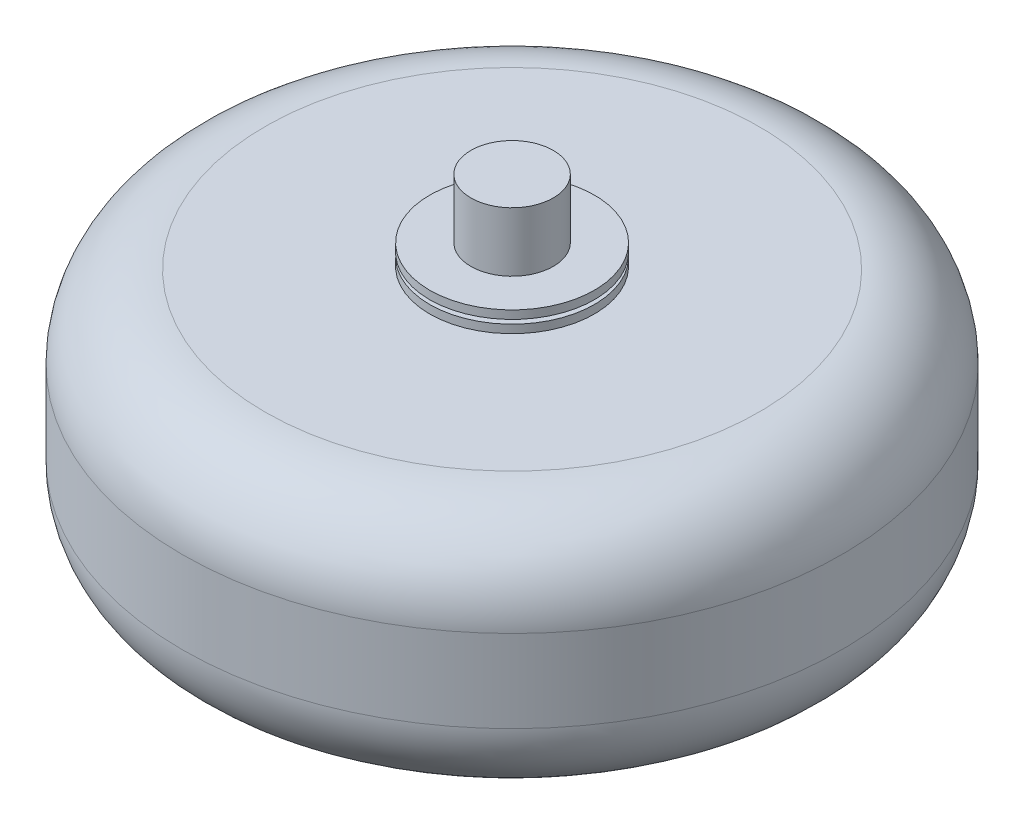
ISO-10303-21;
HEADER;
FILE_DESCRIPTION(('STEP AP214'),'2;1');
FILE_NAME('part.step','',(''),(''),'','','');
FILE_SCHEMA(('AUTOMOTIVE_DESIGN { 1 0 10303 214 1 1 1 1 }'));
ENDSEC;
DATA;
#1=APPLICATION_CONTEXT('core data for automotive mechanical design processes');
#2=APPLICATION_PROTOCOL_DEFINITION('international standard','automotive_design',2000,#1);
#3=PRODUCT_CONTEXT('',#1,'mechanical');
#4=PRODUCT('Part','Part','',(#3));
#5=PRODUCT_RELATED_PRODUCT_CATEGORY('part','',(#4));
#6=PRODUCT_DEFINITION_FORMATION('','',#4);
#7=PRODUCT_DEFINITION_CONTEXT('part definition',#1,'design');
#8=PRODUCT_DEFINITION('design','',#6,#7);
#9=PRODUCT_DEFINITION_SHAPE('','',#8);
#10=(LENGTH_UNIT() NAMED_UNIT(*) SI_UNIT(.MILLI.,.METRE.));
#11=(NAMED_UNIT(*) PLANE_ANGLE_UNIT() SI_UNIT($,.RADIAN.));
#12=(NAMED_UNIT(*) SI_UNIT($,.STERADIAN.) SOLID_ANGLE_UNIT());
#13=UNCERTAINTY_MEASURE_WITH_UNIT(LENGTH_MEASURE(1.E-05),#10,'distance_accuracy_value','');
#14=(GEOMETRIC_REPRESENTATION_CONTEXT(3) GLOBAL_UNCERTAINTY_ASSIGNED_CONTEXT((#13)) GLOBAL_UNIT_ASSIGNED_CONTEXT((#10,
#11,#12)) REPRESENTATION_CONTEXT('',''));
#15=CARTESIAN_POINT('',(0.,0.,0.));
#16=DIRECTION('',(0.,0.,1.));
#17=DIRECTION('',(1.,0.,0.));
#18=AXIS2_PLACEMENT_3D('',#15,#16,#17);
#19=CARTESIAN_POINT('',(0.,-63.5,0.));
#20=DIRECTION('',(0.,1.,0.));
#21=DIRECTION('',(0.,0.,1.));
#22=AXIS2_PLACEMENT_3D('',#19,#20,#21);
#23=CYLINDRICAL_SURFACE('',#22,12.7);
#24=CARTESIAN_POINT('',(0.,-38.1,0.));
#25=DIRECTION('',(0.,-1.,0.));
#26=DIRECTION('',(0.,0.,-1.));
#27=AXIS2_PLACEMENT_3D('',#24,#25,#26);
#28=CIRCLE('',#27,12.7);
#29=CARTESIAN_POINT('',(0.,-38.1,-12.7));
#30=VERTEX_POINT('',#29);
#31=EDGE_CURVE('E99',#30,#30,#28,.T.);
#32=ORIENTED_EDGE('',*,*,#31,.T.);
#33=EDGE_LOOP('',(#32));
#34=FACE_BOUND('',#33,.T.);
#35=CARTESIAN_POINT('',(0.,-38.862,0.));
#36=DIRECTION('',(0.,-1.,0.));
#37=DIRECTION('',(0.,0.,-1.));
#38=AXIS2_PLACEMENT_3D('',#35,#36,#37);
#39=CIRCLE('',#38,12.7);
#40=CARTESIAN_POINT('',(0.,-38.862,-12.7));
#41=VERTEX_POINT('',#40);
#42=EDGE_CURVE('E45',#41,#41,#39,.F.);
#43=ORIENTED_EDGE('',*,*,#42,.T.);
#44=EDGE_LOOP('',(#43));
#45=FACE_BOUND('',#44,.T.);
#46=ADVANCED_FACE('F41',(#34,#45),#23,.T.);
#47=CARTESIAN_POINT('',(0.,38.1,0.));
#48=DIRECTION('',(0.,1.,0.));
#49=DIRECTION('',(0.,0.,1.));
#50=AXIS2_PLACEMENT_3D('',#47,#48,#49);
#51=CIRCLE('',#50,12.7);
#52=CARTESIAN_POINT('',(0.,38.1,12.7));
#53=VERTEX_POINT('',#52);
#54=EDGE_CURVE('E103',#53,#53,#51,.T.);
#55=ORIENTED_EDGE('',*,*,#54,.T.);
#56=EDGE_LOOP('',(#55));
#57=FACE_BOUND('',#56,.T.);
#58=CARTESIAN_POINT('',(0.,38.862,0.));
#59=DIRECTION('',(0.,1.,0.));
#60=DIRECTION('',(0.,0.,1.));
#61=AXIS2_PLACEMENT_3D('',#58,#59,#60);
#62=CIRCLE('',#61,12.7);
#63=CARTESIAN_POINT('',(0.,38.862,12.7));
#64=VERTEX_POINT('',#63);
#65=EDGE_CURVE('E64',#64,#64,#62,.F.);
#66=ORIENTED_EDGE('',*,*,#65,.T.);
#67=EDGE_LOOP('',(#66));
#68=FACE_BOUND('',#67,.T.);
#69=ADVANCED_FACE('F162',(#57,#68),#23,.T.);
#70=CARTESIAN_POINT('',(0.,-38.1,0.));
#71=DIRECTION('',(0.,1.,0.));
#72=DIRECTION('',(0.,0.,1.));
#73=AXIS2_PLACEMENT_3D('',#70,#71,#72);
#74=CYLINDRICAL_SURFACE('',#73,101.6);
#75=CARTESIAN_POINT('',(0.,12.7,0.));
#76=DIRECTION('',(0.,1.,0.));
#77=DIRECTION('',(0.,0.,1.));
#78=AXIS2_PLACEMENT_3D('',#75,#76,#77);
#79=CIRCLE('',#78,101.6);
#80=CARTESIAN_POINT('',(0.,12.7,101.6));
#81=VERTEX_POINT('',#80);
#82=EDGE_CURVE('E87',#81,#81,#79,.F.);
#83=ORIENTED_EDGE('',*,*,#82,.T.);
#84=EDGE_LOOP('',(#83));
#85=FACE_BOUND('',#84,.T.);
#86=CARTESIAN_POINT('',(0.,-12.7,0.));
#87=DIRECTION('',(0.,1.,0.));
#88=DIRECTION('',(0.,0.,1.));
#89=AXIS2_PLACEMENT_3D('',#86,#87,#88);
#90=CIRCLE('',#89,101.6);
#91=CARTESIAN_POINT('',(0.,-12.7,101.6));
#92=VERTEX_POINT('',#91);
#93=EDGE_CURVE('E91',#92,#92,#90,.T.);
#94=ORIENTED_EDGE('',*,*,#93,.T.);
#95=EDGE_LOOP('',(#94));
#96=FACE_BOUND('',#95,.T.);
#97=ADVANCED_FACE('F172',(#85,#96),#74,.T.);
#98=CARTESIAN_POINT('',(0.,-38.1,0.));
#99=DIRECTION('',(0.,1.,0.));
#100=DIRECTION('',(0.,0.,1.));
#101=AXIS2_PLACEMENT_3D('',#98,#99,#100);
#102=PLANE('',#101);
#103=CARTESIAN_POINT('',(0.,-38.1,0.));
#104=DIRECTION('',(0.,1.,0.));
#105=DIRECTION('',(0.,0.,1.));
#106=AXIS2_PLACEMENT_3D('',#103,#104,#105);
#107=CIRCLE('',#106,76.2);
#108=CARTESIAN_POINT('',(0.,-38.1,76.2));
#109=VERTEX_POINT('',#108);
#110=EDGE_CURVE('E77',#109,#109,#107,.F.);
#111=ORIENTED_EDGE('',*,*,#110,.T.);
#112=EDGE_LOOP('',(#111));
#113=FACE_BOUND('',#112,.T.);
#114=ORIENTED_EDGE('',*,*,#31,.F.);
#115=EDGE_LOOP('',(#114));
#116=FACE_BOUND('',#115,.T.);
#117=ADVANCED_FACE('F345',(#113,#116),#102,.F.);
#118=CARTESIAN_POINT('',(0.,38.1,0.));
#119=DIRECTION('',(0.,1.,0.));
#120=DIRECTION('',(0.,0.,1.));
#121=AXIS2_PLACEMENT_3D('',#118,#119,#120);
#122=PLANE('',#121);
#123=CARTESIAN_POINT('',(0.,38.1,0.));
#124=DIRECTION('',(0.,1.,0.));
#125=DIRECTION('',(0.,0.,1.));
#126=AXIS2_PLACEMENT_3D('',#123,#124,#125);
#127=CIRCLE('',#126,76.2);
#128=CARTESIAN_POINT('',(0.,38.1,76.2));
#129=VERTEX_POINT('',#128);
#130=EDGE_CURVE('E95',#129,#129,#127,.T.);
#131=ORIENTED_EDGE('',*,*,#130,.T.);
#132=EDGE_LOOP('',(#131));
#133=FACE_BOUND('',#132,.T.);
#134=ORIENTED_EDGE('',*,*,#54,.F.);
#135=EDGE_LOOP('',(#134));
#136=FACE_BOUND('',#135,.T.);
#137=ADVANCED_FACE('F335',(#133,#136),#122,.T.);
#138=CARTESIAN_POINT('',(0.,12.7,0.));
#139=DIRECTION('',(0.,1.,0.));
#140=DIRECTION('',(0.,0.,1.));
#141=AXIS2_PLACEMENT_3D('',#138,#139,#140);
#142=TOROIDAL_SURFACE('',#141,76.2,25.4);
#143=ORIENTED_EDGE('',*,*,#82,.F.);
#144=EDGE_LOOP('',(#143));
#145=FACE_BOUND('',#144,.T.);
#146=ORIENTED_EDGE('',*,*,#130,.F.);
#147=EDGE_LOOP('',(#146));
#148=FACE_BOUND('',#147,.T.);
#149=ADVANCED_FACE('F325',(#145,#148),#142,.T.);
#150=CARTESIAN_POINT('',(0.,-12.7,0.));
#151=DIRECTION('',(0.,1.,0.));
#152=DIRECTION('',(0.,0.,1.));
#153=AXIS2_PLACEMENT_3D('',#150,#151,#152);
#154=TOROIDAL_SURFACE('',#153,76.2,25.4);
#155=ORIENTED_EDGE('',*,*,#110,.F.);
#156=EDGE_LOOP('',(#155));
#157=FACE_BOUND('',#156,.T.);
#158=ORIENTED_EDGE('',*,*,#93,.F.);
#159=EDGE_LOOP('',(#158));
#160=FACE_BOUND('',#159,.T.);
#161=ADVANCED_FACE('F43',(#157,#160),#154,.T.);
#162=CARTESIAN_POINT('',(0.,38.862,0.));
#163=DIRECTION('',(0.,1.,0.));
#164=DIRECTION('',(0.,0.,1.));
#165=AXIS2_PLACEMENT_3D('',#162,#163,#164);
#166=CYLINDRICAL_SURFACE('',#165,25.4);
#167=CARTESIAN_POINT('',(0.,38.862,0.));
#168=DIRECTION('',(0.,1.,0.));
#169=DIRECTION('',(0.,0.,1.));
#170=AXIS2_PLACEMENT_3D('',#167,#168,#169);
#171=CIRCLE('',#170,25.4);
#172=CARTESIAN_POINT('',(0.,38.862,25.4));
#173=VERTEX_POINT('',#172);
#174=EDGE_CURVE('E69',#173,#173,#171,.T.);
#175=ORIENTED_EDGE('',*,*,#174,.T.);
#176=EDGE_LOOP('',(#175));
#177=FACE_BOUND('',#176,.T.);
#178=CARTESIAN_POINT('',(0.,41.402,0.));
#179=DIRECTION('',(0.,1.,0.));
#180=DIRECTION('',(0.,0.,1.));
#181=AXIS2_PLACEMENT_3D('',#178,#179,#180);
#182=CIRCLE('',#181,25.4);
#183=CARTESIAN_POINT('',(0.,41.402,25.4));
#184=VERTEX_POINT('',#183);
#185=EDGE_CURVE('E62',#184,#184,#182,.T.);
#186=ORIENTED_EDGE('',*,*,#185,.F.);
#187=EDGE_LOOP('',(#186));
#188=FACE_BOUND('',#187,.T.);
#189=ADVANCED_FACE('F233',(#177,#188),#166,.T.);
#190=CARTESIAN_POINT('',(0.,38.862,0.));
#191=DIRECTION('',(0.,1.,0.));
#192=DIRECTION('',(0.,0.,1.));
#193=AXIS2_PLACEMENT_3D('',#190,#191,#192);
#194=PLANE('',#193);
#195=ORIENTED_EDGE('',*,*,#65,.F.);
#196=EDGE_LOOP('',(#195));
#197=FACE_BOUND('',#196,.T.);
#198=ORIENTED_EDGE('',*,*,#174,.F.);
#199=EDGE_LOOP('',(#198));
#200=FACE_BOUND('',#199,.T.);
#201=ADVANCED_FACE('F236',(#197,#200),#194,.F.);
#202=CARTESIAN_POINT('',(0.,41.402,0.));
#203=DIRECTION('',(0.,1.,0.));
#204=DIRECTION('',(0.,0.,1.));
#205=AXIS2_PLACEMENT_3D('',#202,#203,#204);
#206=PLANE('',#205);
#207=CARTESIAN_POINT('',(0.,41.402,0.));
#208=DIRECTION('',(0.,1.,0.));
#209=DIRECTION('',(0.,0.,1.));
#210=AXIS2_PLACEMENT_3D('',#207,#208,#209);
#211=CIRCLE('',#210,12.7);
#212=CARTESIAN_POINT('',(0.,41.402,12.7));
#213=VERTEX_POINT('',#212);
#214=EDGE_CURVE('E55',#213,#213,#211,.F.);
#215=ORIENTED_EDGE('',*,*,#214,.T.);
#216=EDGE_LOOP('',(#215));
#217=FACE_BOUND('',#216,.T.);
#218=ORIENTED_EDGE('',*,*,#185,.T.);
#219=EDGE_LOOP('',(#218));
#220=FACE_BOUND('',#219,.T.);
#221=ADVANCED_FACE('F192',(#217,#220),#206,.T.);
#222=CARTESIAN_POINT('',(0.,63.5,0.));
#223=DIRECTION('',(0.,1.,0.));
#224=DIRECTION('',(0.,0.,1.));
#225=AXIS2_PLACEMENT_3D('',#222,#223,#224);
#226=PLANE('',#225);
#227=CARTESIAN_POINT('',(0.,63.5,0.));
#228=DIRECTION('',(0.,1.,0.));
#229=DIRECTION('',(0.,0.,1.));
#230=AXIS2_PLACEMENT_3D('',#227,#228,#229);
#231=CIRCLE('',#230,12.7);
#232=CARTESIAN_POINT('',(0.,63.5,12.7));
#233=VERTEX_POINT('',#232);
#234=EDGE_CURVE('E82',#233,#233,#231,.T.);
#235=ORIENTED_EDGE('',*,*,#234,.T.);
#236=EDGE_LOOP('',(#235));
#237=FACE_BOUND('',#236,.T.);
#238=ADVANCED_FACE('F181',(#237),#226,.T.);
#239=CARTESIAN_POINT('',(0.,45.212,0.));
#240=DIRECTION('',(0.,1.,0.));
#241=DIRECTION('',(0.,0.,1.));
#242=AXIS2_PLACEMENT_3D('',#239,#240,#241);
#243=CIRCLE('',#242,12.7);
#244=CARTESIAN_POINT('',(0.,45.212,12.7));
#245=VERTEX_POINT('',#244);
#246=EDGE_CURVE('E73',#245,#245,#243,.F.);
#247=ORIENTED_EDGE('',*,*,#246,.F.);
#248=EDGE_LOOP('',(#247));
#249=FACE_BOUND('',#248,.T.);
#250=ORIENTED_EDGE('',*,*,#234,.F.);
#251=EDGE_LOOP('',(#250));
#252=FACE_BOUND('',#251,.T.);
#253=ADVANCED_FACE('F166',(#249,#252),#23,.T.);
#254=CARTESIAN_POINT('',(0.,45.212,0.));
#255=DIRECTION('',(0.,1.,0.));
#256=DIRECTION('',(0.,0.,1.));
#257=AXIS2_PLACEMENT_3D('',#254,#255,#256);
#258=PLANE('',#257);
#259=ORIENTED_EDGE('',*,*,#246,.T.);
#260=EDGE_LOOP('',(#259));
#261=FACE_BOUND('',#260,.T.);
#262=CARTESIAN_POINT('',(0.,45.212,0.));
#263=DIRECTION('',(0.,1.,0.));
#264=DIRECTION('',(0.,0.,1.));
#265=AXIS2_PLACEMENT_3D('',#262,#263,#264);
#266=CIRCLE('',#265,25.4);
#267=CARTESIAN_POINT('',(0.,45.212,25.4));
#268=VERTEX_POINT('',#267);
#269=EDGE_CURVE('E83',#268,#268,#266,.T.);
#270=ORIENTED_EDGE('',*,*,#269,.T.);
#271=EDGE_LOOP('',(#270));
#272=FACE_BOUND('',#271,.T.);
#273=ADVANCED_FACE('F180',(#261,#272),#258,.T.);
#274=CARTESIAN_POINT('',(0.,45.212,0.));
#275=DIRECTION('',(0.,-1.,0.));
#276=DIRECTION('',(0.,0.,-1.));
#277=AXIS2_PLACEMENT_3D('',#274,#275,#276);
#278=CYLINDRICAL_SURFACE('',#277,25.4);
#279=ORIENTED_EDGE('',*,*,#269,.F.);
#280=EDGE_LOOP('',(#279));
#281=FACE_BOUND('',#280,.T.);
#282=CARTESIAN_POINT('',(0.,42.672,0.));
#283=DIRECTION('',(0.,1.,0.));
#284=DIRECTION('',(0.,0.,1.));
#285=AXIS2_PLACEMENT_3D('',#282,#283,#284);
#286=CIRCLE('',#285,25.4);
#287=CARTESIAN_POINT('',(0.,42.672,25.4));
#288=VERTEX_POINT('',#287);
#289=EDGE_CURVE('E68',#288,#288,#286,.T.);
#290=ORIENTED_EDGE('',*,*,#289,.T.);
#291=EDGE_LOOP('',(#290));
#292=FACE_BOUND('',#291,.T.);
#293=ADVANCED_FACE('F188',(#281,#292),#278,.T.);
#294=CARTESIAN_POINT('',(0.,42.672,0.));
#295=DIRECTION('',(0.,1.,0.));
#296=DIRECTION('',(0.,0.,1.));
#297=AXIS2_PLACEMENT_3D('',#294,#295,#296);
#298=PLANE('',#297);
#299=CARTESIAN_POINT('',(0.,42.672,0.));
#300=DIRECTION('',(0.,1.,0.));
#301=DIRECTION('',(0.,0.,1.));
#302=AXIS2_PLACEMENT_3D('',#299,#300,#301);
#303=CIRCLE('',#302,12.7);
#304=CARTESIAN_POINT('',(0.,42.672,12.7));
#305=VERTEX_POINT('',#304);
#306=EDGE_CURVE('E78',#305,#305,#303,.F.);
#307=ORIENTED_EDGE('',*,*,#306,.F.);
#308=EDGE_LOOP('',(#307));
#309=FACE_BOUND('',#308,.T.);
#310=ORIENTED_EDGE('',*,*,#289,.F.);
#311=EDGE_LOOP('',(#310));
#312=FACE_BOUND('',#311,.T.);
#313=ADVANCED_FACE('F212',(#309,#312),#298,.F.);
#314=ORIENTED_EDGE('',*,*,#214,.F.);
#315=EDGE_LOOP('',(#314));
#316=FACE_BOUND('',#315,.T.);
#317=ORIENTED_EDGE('',*,*,#306,.T.);
#318=EDGE_LOOP('',(#317));
#319=FACE_BOUND('',#318,.T.);
#320=ADVANCED_FACE('F158',(#316,#319),#23,.T.);
#321=CARTESIAN_POINT('',(0.,-38.862,0.));
#322=DIRECTION('',(0.,-1.,0.));
#323=DIRECTION('',(0.,0.,-1.));
#324=AXIS2_PLACEMENT_3D('',#321,#322,#323);
#325=CYLINDRICAL_SURFACE('',#324,25.4);
#326=CARTESIAN_POINT('',(0.,-38.862,0.));
#327=DIRECTION('',(0.,1.,0.));
#328=DIRECTION('',(0.,0.,1.));
#329=AXIS2_PLACEMENT_3D('',#326,#327,#328);
#330=CIRCLE('',#329,25.4);
#331=CARTESIAN_POINT('',(0.,-38.862,25.4));
#332=VERTEX_POINT('',#331);
#333=EDGE_CURVE('E137',#332,#332,#330,.T.);
#334=ORIENTED_EDGE('',*,*,#333,.F.);
#335=EDGE_LOOP('',(#334));
#336=FACE_BOUND('',#335,.T.);
#337=CARTESIAN_POINT('',(0.,-41.402,0.));
#338=DIRECTION('',(0.,1.,0.));
#339=DIRECTION('',(0.,0.,1.));
#340=AXIS2_PLACEMENT_3D('',#337,#338,#339);
#341=CIRCLE('',#340,25.4);
#342=CARTESIAN_POINT('',(0.,-41.402,25.4));
#343=VERTEX_POINT('',#342);
#344=EDGE_CURVE('E133',#343,#343,#341,.T.);
#345=ORIENTED_EDGE('',*,*,#344,.T.);
#346=EDGE_LOOP('',(#345));
#347=FACE_BOUND('',#346,.T.);
#348=ADVANCED_FACE('F150',(#336,#347),#325,.T.);
#349=CARTESIAN_POINT('',(0.,-38.862,0.));
#350=DIRECTION('',(0.,-1.,0.));
#351=DIRECTION('',(0.,0.,1.));
#352=AXIS2_PLACEMENT_3D('',#349,#350,#351);
#353=PLANE('',#352);
#354=ORIENTED_EDGE('',*,*,#42,.F.);
#355=EDGE_LOOP('',(#354));
#356=FACE_BOUND('',#355,.T.);
#357=ORIENTED_EDGE('',*,*,#333,.T.);
#358=EDGE_LOOP('',(#357));
#359=FACE_BOUND('',#358,.T.);
#360=ADVANCED_FACE('F147',(#356,#359),#353,.F.);
#361=CARTESIAN_POINT('',(0.,-41.402,0.));
#362=DIRECTION('',(0.,-1.,0.));
#363=DIRECTION('',(0.,0.,1.));
#364=AXIS2_PLACEMENT_3D('',#361,#362,#363);
#365=PLANE('',#364);
#366=CARTESIAN_POINT('',(0.,-41.402,0.));
#367=DIRECTION('',(0.,-1.,0.));
#368=DIRECTION('',(0.,0.,-1.));
#369=AXIS2_PLACEMENT_3D('',#366,#367,#368);
#370=CIRCLE('',#369,12.7);
#371=CARTESIAN_POINT('',(0.,-41.402,-12.7));
#372=VERTEX_POINT('',#371);
#373=EDGE_CURVE('E10',#372,#372,#370,.F.);
#374=ORIENTED_EDGE('',*,*,#373,.T.);
#375=EDGE_LOOP('',(#374));
#376=FACE_BOUND('',#375,.T.);
#377=ORIENTED_EDGE('',*,*,#344,.F.);
#378=EDGE_LOOP('',(#377));
#379=FACE_BOUND('',#378,.T.);
#380=ADVANCED_FACE('F149',(#376,#379),#365,.T.);
#381=CARTESIAN_POINT('',(0.,-63.5,0.));
#382=DIRECTION('',(0.,1.,0.));
#383=DIRECTION('',(0.,0.,1.));
#384=AXIS2_PLACEMENT_3D('',#381,#382,#383);
#385=PLANE('',#384);
#386=CARTESIAN_POINT('',(0.,-63.5,0.));
#387=DIRECTION('',(0.,1.,0.));
#388=DIRECTION('',(0.,0.,1.));
#389=AXIS2_PLACEMENT_3D('',#386,#387,#388);
#390=CIRCLE('',#389,12.7);
#391=CARTESIAN_POINT('',(0.,-63.5,12.7));
#392=VERTEX_POINT('',#391);
#393=EDGE_CURVE('E107',#392,#392,#390,.T.);
#394=ORIENTED_EDGE('',*,*,#393,.F.);
#395=EDGE_LOOP('',(#394));
#396=FACE_BOUND('',#395,.T.);
#397=ADVANCED_FACE('F156',(#396),#385,.F.);
#398=CARTESIAN_POINT('',(0.,-45.212,0.));
#399=DIRECTION('',(0.,-1.,0.));
#400=DIRECTION('',(0.,0.,-1.));
#401=AXIS2_PLACEMENT_3D('',#398,#399,#400);
#402=CIRCLE('',#401,12.7);
#403=CARTESIAN_POINT('',(0.,-45.212,-12.7));
#404=VERTEX_POINT('',#403);
#405=EDGE_CURVE('E50',#404,#404,#402,.F.);
#406=ORIENTED_EDGE('',*,*,#405,.F.);
#407=EDGE_LOOP('',(#406));
#408=FACE_BOUND('',#407,.T.);
#409=ORIENTED_EDGE('',*,*,#393,.T.);
#410=EDGE_LOOP('',(#409));
#411=FACE_BOUND('',#410,.T.);
#412=ADVANCED_FACE('F183',(#408,#411),#23,.T.);
#413=CARTESIAN_POINT('',(0.,-45.212,0.));
#414=DIRECTION('',(0.,-1.,0.));
#415=DIRECTION('',(0.,0.,1.));
#416=AXIS2_PLACEMENT_3D('',#413,#414,#415);
#417=PLANE('',#416);
#418=ORIENTED_EDGE('',*,*,#405,.T.);
#419=EDGE_LOOP('',(#418));
#420=FACE_BOUND('',#419,.T.);
#421=CARTESIAN_POINT('',(0.,-45.212,0.));
#422=DIRECTION('',(0.,1.,0.));
#423=DIRECTION('',(0.,0.,1.));
#424=AXIS2_PLACEMENT_3D('',#421,#422,#423);
#425=CIRCLE('',#424,25.4);
#426=CARTESIAN_POINT('',(0.,-45.212,25.4));
#427=VERTEX_POINT('',#426);
#428=EDGE_CURVE('E63',#427,#427,#425,.T.);
#429=ORIENTED_EDGE('',*,*,#428,.F.);
#430=EDGE_LOOP('',(#429));
#431=FACE_BOUND('',#430,.T.);
#432=ADVANCED_FACE('F198',(#420,#431),#417,.T.);
#433=CARTESIAN_POINT('',(0.,-45.212,0.));
#434=DIRECTION('',(0.,1.,0.));
#435=DIRECTION('',(0.,0.,1.));
#436=AXIS2_PLACEMENT_3D('',#433,#434,#435);
#437=CYLINDRICAL_SURFACE('',#436,25.4);
#438=ORIENTED_EDGE('',*,*,#428,.T.);
#439=EDGE_LOOP('',(#438));
#440=FACE_BOUND('',#439,.T.);
#441=CARTESIAN_POINT('',(0.,-42.672,0.));
#442=DIRECTION('',(0.,1.,0.));
#443=DIRECTION('',(0.,0.,1.));
#444=AXIS2_PLACEMENT_3D('',#441,#442,#443);
#445=CIRCLE('',#444,25.4);
#446=CARTESIAN_POINT('',(0.,-42.672,25.4));
#447=VERTEX_POINT('',#446);
#448=EDGE_CURVE('E126',#447,#447,#445,.T.);
#449=ORIENTED_EDGE('',*,*,#448,.F.);
#450=EDGE_LOOP('',(#449));
#451=FACE_BOUND('',#450,.T.);
#452=ADVANCED_FACE('F205',(#440,#451),#437,.T.);
#453=CARTESIAN_POINT('',(0.,-42.672,0.));
#454=DIRECTION('',(0.,-1.,0.));
#455=DIRECTION('',(0.,0.,1.));
#456=AXIS2_PLACEMENT_3D('',#453,#454,#455);
#457=PLANE('',#456);
#458=CARTESIAN_POINT('',(0.,-42.672,0.));
#459=DIRECTION('',(0.,-1.,0.));
#460=DIRECTION('',(0.,0.,-1.));
#461=AXIS2_PLACEMENT_3D('',#458,#459,#460);
#462=CIRCLE('',#461,12.7);
#463=CARTESIAN_POINT('',(0.,-42.672,-12.7));
#464=VERTEX_POINT('',#463);
#465=EDGE_CURVE('E58',#464,#464,#462,.F.);
#466=ORIENTED_EDGE('',*,*,#465,.F.);
#467=EDGE_LOOP('',(#466));
#468=FACE_BOUND('',#467,.T.);
#469=ORIENTED_EDGE('',*,*,#448,.T.);
#470=EDGE_LOOP('',(#469));
#471=FACE_BOUND('',#470,.T.);
#472=ADVANCED_FACE('F177',(#468,#471),#457,.F.);
#473=ORIENTED_EDGE('',*,*,#373,.F.);
#474=EDGE_LOOP('',(#473));
#475=FACE_BOUND('',#474,.T.);
#476=ORIENTED_EDGE('',*,*,#465,.T.);
#477=EDGE_LOOP('',(#476));
#478=FACE_BOUND('',#477,.T.);
#479=ADVANCED_FACE('F165',(#475,#478),#23,.T.);
#480=CLOSED_SHELL('',(#46,#69,#97,#117,#137,#149,#161,#189,#201,#221,#238,#253,#273,#293,#313,
#320,#348,#360,#380,#397,#412,#432,#452,#472,#479));
#481=MANIFOLD_SOLID_BREP('B2',#480);
#482=ADVANCED_BREP_SHAPE_REPRESENTATION('',(#18,#481),#14);
#483=SHAPE_DEFINITION_REPRESENTATION(#9,#482);
ENDSEC;
END-ISO-10303-21;
